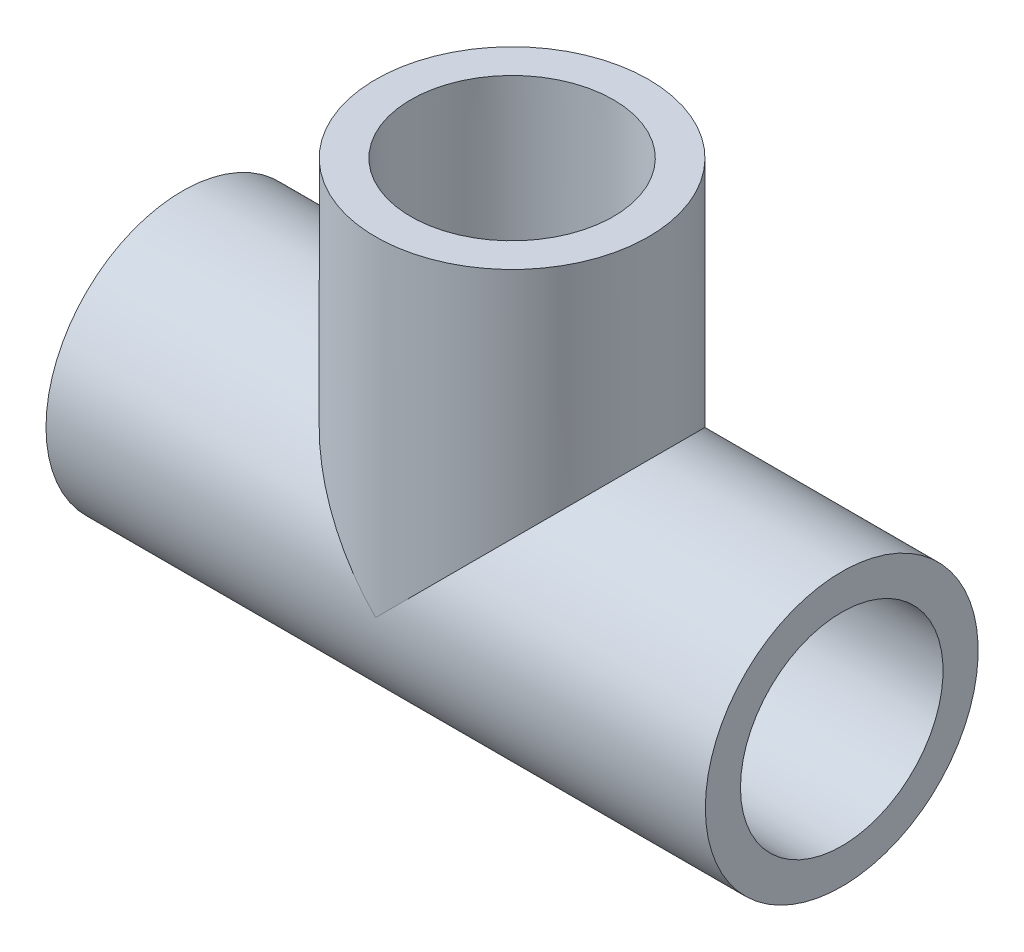
ISO-10303-21;
HEADER;
FILE_DESCRIPTION(('STEP AP214'),'2;1');
FILE_NAME('part.step','',(''),(''),'','','');
FILE_SCHEMA(('AUTOMOTIVE_DESIGN { 1 0 10303 214 1 1 1 1 }'));
ENDSEC;
DATA;
#1=APPLICATION_CONTEXT('core data for automotive mechanical design processes');
#2=APPLICATION_PROTOCOL_DEFINITION('international standard','automotive_design',2000,#1);
#3=PRODUCT_CONTEXT('',#1,'mechanical');
#4=PRODUCT('Part','Part','',(#3));
#5=PRODUCT_RELATED_PRODUCT_CATEGORY('part','',(#4));
#6=PRODUCT_DEFINITION_FORMATION('','',#4);
#7=PRODUCT_DEFINITION_CONTEXT('part definition',#1,'design');
#8=PRODUCT_DEFINITION('design','',#6,#7);
#9=PRODUCT_DEFINITION_SHAPE('','',#8);
#10=(LENGTH_UNIT() NAMED_UNIT(*) SI_UNIT(.MILLI.,.METRE.));
#11=(NAMED_UNIT(*) PLANE_ANGLE_UNIT() SI_UNIT($,.RADIAN.));
#12=(NAMED_UNIT(*) SI_UNIT($,.STERADIAN.) SOLID_ANGLE_UNIT());
#13=UNCERTAINTY_MEASURE_WITH_UNIT(LENGTH_MEASURE(1.E-05),#10,'distance_accuracy_value','');
#14=(GEOMETRIC_REPRESENTATION_CONTEXT(3) GLOBAL_UNCERTAINTY_ASSIGNED_CONTEXT((#13)) GLOBAL_UNIT_ASSIGNED_CONTEXT((#10,
#11,#12)) REPRESENTATION_CONTEXT('',''));
#15=CARTESIAN_POINT('',(0.,0.,0.));
#16=DIRECTION('',(0.,0.,1.));
#17=DIRECTION('',(1.,0.,0.));
#18=AXIS2_PLACEMENT_3D('',#15,#16,#17);
#19=CARTESIAN_POINT('',(-35.052,0.,0.));
#20=DIRECTION('',(-1.,0.,0.));
#21=DIRECTION('',(0.,0.,1.));
#22=AXIS2_PLACEMENT_3D('',#19,#20,#21);
#23=CYLINDRICAL_SURFACE('',#22,14.5034);
#24=CARTESIAN_POINT('',(-35.052,0.,0.));
#25=DIRECTION('',(-1.,0.,0.));
#26=DIRECTION('',(0.,0.,1.));
#27=AXIS2_PLACEMENT_3D('',#24,#25,#26);
#28=CIRCLE('',#27,14.5034);
#29=CARTESIAN_POINT('',(-35.052,0.,14.5034));
#30=VERTEX_POINT('',#29);
#31=EDGE_CURVE('E96',#30,#30,#28,.T.);
#32=ORIENTED_EDGE('',*,*,#31,.F.);
#33=EDGE_LOOP('',(#32));
#34=FACE_BOUND('',#33,.T.);
#35=CARTESIAN_POINT('',(35.052,0.,0.));
#36=DIRECTION('',(-1.,0.,0.));
#37=DIRECTION('',(0.,0.,1.));
#38=AXIS2_PLACEMENT_3D('',#35,#36,#37);
#39=CIRCLE('',#38,14.5034);
#40=CARTESIAN_POINT('',(35.052,0.,14.5034));
#41=VERTEX_POINT('',#40);
#42=EDGE_CURVE('E74',#41,#41,#39,.T.);
#43=ORIENTED_EDGE('',*,*,#42,.T.);
#44=EDGE_LOOP('',(#43));
#45=FACE_BOUND('',#44,.T.);
#46=CARTESIAN_POINT('',(0.,0.,0.));
#47=DIRECTION('',(-0.707106781186547,-0.707106781186547,0.));
#48=DIRECTION('',(-0.707106781186547,0.707106781186547,0.));
#49=AXIS2_PLACEMENT_3D('',#46,#47,#48);
#50=ELLIPSE('',#49,20.5109049805219,14.5034);
#51=CARTESIAN_POINT('',(0.,0.,-14.5034));
#52=VERTEX_POINT('',#51);
#53=CARTESIAN_POINT('',(0.,0.,14.5034));
#54=VERTEX_POINT('',#53);
#55=EDGE_CURVE('E51',#52,#54,#50,.F.);
#56=ORIENTED_EDGE('',*,*,#55,.F.);
#57=CARTESIAN_POINT('',(0.,0.,0.));
#58=DIRECTION('',(0.707106781186547,-0.707106781186547,0.));
#59=DIRECTION('',(-0.707106781186547,-0.707106781186547,0.));
#60=AXIS2_PLACEMENT_3D('',#57,#58,#59);
#61=ELLIPSE('',#60,20.5109049805219,14.5034);
#62=EDGE_CURVE('E87',#52,#54,#61,.T.);
#63=ORIENTED_EDGE('',*,*,#62,.T.);
#64=EDGE_LOOP('',(#56,#63));
#65=FACE_BOUND('',#64,.T.);
#66=ADVANCED_FACE('F32',(#34,#45,#65),#23,.T.);
#67=CARTESIAN_POINT('',(-35.052,-14.5034,0.));
#68=DIRECTION('',(-1.,0.,0.));
#69=DIRECTION('',(0.,0.,1.));
#70=AXIS2_PLACEMENT_3D('',#67,#68,#69);
#71=PLANE('',#70);
#72=ORIENTED_EDGE('',*,*,#31,.T.);
#73=EDGE_LOOP('',(#72));
#74=FACE_BOUND('',#73,.T.);
#75=CARTESIAN_POINT('',(-35.052,0.,0.));
#76=DIRECTION('',(-1.,0.,0.));
#77=DIRECTION('',(0.,0.,1.));
#78=AXIS2_PLACEMENT_3D('',#75,#76,#77);
#79=CIRCLE('',#78,10.7696);
#80=CARTESIAN_POINT('',(-35.052,0.,10.7696));
#81=VERTEX_POINT('',#80);
#82=EDGE_CURVE('E104',#81,#81,#79,.T.);
#83=ORIENTED_EDGE('',*,*,#82,.F.);
#84=EDGE_LOOP('',(#83));
#85=FACE_BOUND('',#84,.T.);
#86=ADVANCED_FACE('F34',(#74,#85),#71,.T.);
#87=CARTESIAN_POINT('',(-12.7,0.,0.));
#88=DIRECTION('',(-1.,0.,0.));
#89=DIRECTION('',(0.,0.,1.));
#90=AXIS2_PLACEMENT_3D('',#87,#88,#89);
#91=CONICAL_SURFACE('',#90,10.6172,0.00681807616748466);
#92=ORIENTED_EDGE('',*,*,#82,.T.);
#93=EDGE_LOOP('',(#92));
#94=FACE_BOUND('',#93,.T.);
#95=CARTESIAN_POINT('',(-12.7,0.,0.));
#96=DIRECTION('',(-1.,0.,0.));
#97=DIRECTION('',(0.,0.,1.));
#98=AXIS2_PLACEMENT_3D('',#95,#96,#97);
#99=CIRCLE('',#98,10.6172);
#100=CARTESIAN_POINT('',(-12.7,0.,10.6172));
#101=VERTEX_POINT('',#100);
#102=EDGE_CURVE('E101',#101,#101,#99,.T.);
#103=ORIENTED_EDGE('',*,*,#102,.F.);
#104=EDGE_LOOP('',(#103));
#105=FACE_BOUND('',#104,.T.);
#106=ADVANCED_FACE('F138',(#94,#105),#91,.F.);
#107=CARTESIAN_POINT('',(52.4670644855765,12.7,-7.00418528881125));
#108=DIRECTION('',(0.,-1.,0.));
#109=DIRECTION('',(0.,0.,-1.));
#110=AXIS2_PLACEMENT_3D('',#107,#108,#109);
#111=PLANE('',#110);
#112=CARTESIAN_POINT('',(0.,12.7,0.));
#113=DIRECTION('',(0.,1.,0.));
#114=DIRECTION('',(0.,0.,1.));
#115=AXIS2_PLACEMENT_3D('',#112,#113,#114);
#116=CIRCLE('',#115,6.9342);
#117=CARTESIAN_POINT('',(0.,12.7,6.9342));
#118=VERTEX_POINT('',#117);
#119=EDGE_CURVE('E72',#118,#118,#116,.T.);
#120=ORIENTED_EDGE('',*,*,#119,.F.);
#121=EDGE_LOOP('',(#120));
#122=FACE_BOUND('',#121,.T.);
#123=CARTESIAN_POINT('',(0.,12.7,0.));
#124=DIRECTION('',(0.,-1.,0.));
#125=DIRECTION('',(0.,0.,-1.));
#126=AXIS2_PLACEMENT_3D('',#123,#124,#125);
#127=CIRCLE('',#126,10.6172);
#128=CARTESIAN_POINT('',(0.,12.7,-10.6172));
#129=VERTEX_POINT('',#128);
#130=EDGE_CURVE('E58',#129,#129,#127,.F.);
#131=ORIENTED_EDGE('',*,*,#130,.T.);
#132=EDGE_LOOP('',(#131));
#133=FACE_BOUND('',#132,.T.);
#134=ADVANCED_FACE('F110',(#122,#133),#111,.F.);
#135=CARTESIAN_POINT('',(-12.7,0.,0.));
#136=DIRECTION('',(1.,0.,0.));
#137=DIRECTION('',(0.,0.,-1.));
#138=AXIS2_PLACEMENT_3D('',#135,#136,#137);
#139=PLANE('',#138);
#140=CARTESIAN_POINT('',(-12.7,0.,0.));
#141=DIRECTION('',(-1.,0.,0.));
#142=DIRECTION('',(0.,0.,1.));
#143=AXIS2_PLACEMENT_3D('',#140,#141,#142);
#144=CIRCLE('',#143,6.9342);
#145=CARTESIAN_POINT('',(-12.7,0.,6.9342));
#146=VERTEX_POINT('',#145);
#147=EDGE_CURVE('E70',#146,#146,#144,.T.);
#148=ORIENTED_EDGE('',*,*,#147,.F.);
#149=EDGE_LOOP('',(#148));
#150=FACE_BOUND('',#149,.T.);
#151=ORIENTED_EDGE('',*,*,#102,.T.);
#152=EDGE_LOOP('',(#151));
#153=FACE_BOUND('',#152,.T.);
#154=ADVANCED_FACE('F123',(#150,#153),#139,.F.);
#155=CARTESIAN_POINT('',(14.5034,35.052,0.));
#156=DIRECTION('',(0.,1.,0.));
#157=DIRECTION('',(0.,0.,1.));
#158=AXIS2_PLACEMENT_3D('',#155,#156,#157);
#159=PLANE('',#158);
#160=CARTESIAN_POINT('',(0.,35.052,0.));
#161=DIRECTION('',(0.,-1.,0.));
#162=DIRECTION('',(0.,0.,-1.));
#163=AXIS2_PLACEMENT_3D('',#160,#161,#162);
#164=CIRCLE('',#163,10.7696);
#165=CARTESIAN_POINT('',(0.,35.052,-10.7696));
#166=VERTEX_POINT('',#165);
#167=EDGE_CURVE('E89',#166,#166,#164,.T.);
#168=ORIENTED_EDGE('',*,*,#167,.T.);
#169=EDGE_LOOP('',(#168));
#170=FACE_BOUND('',#169,.T.);
#171=CARTESIAN_POINT('',(0.,35.052,0.));
#172=DIRECTION('',(0.,-1.,0.));
#173=DIRECTION('',(0.,0.,-1.));
#174=AXIS2_PLACEMENT_3D('',#171,#172,#173);
#175=CIRCLE('',#174,14.5034);
#176=CARTESIAN_POINT('',(0.,35.052,-14.5034));
#177=VERTEX_POINT('',#176);
#178=EDGE_CURVE('E92',#177,#177,#175,.T.);
#179=ORIENTED_EDGE('',*,*,#178,.F.);
#180=EDGE_LOOP('',(#179));
#181=FACE_BOUND('',#180,.T.);
#182=ADVANCED_FACE('F120',(#170,#181),#159,.T.);
#183=CARTESIAN_POINT('',(0.,0.,0.));
#184=DIRECTION('',(0.,-1.,0.));
#185=DIRECTION('',(0.,0.,-1.));
#186=AXIS2_PLACEMENT_3D('',#183,#184,#185);
#187=CYLINDRICAL_SURFACE('',#186,14.5034);
#188=ORIENTED_EDGE('',*,*,#62,.F.);
#189=ORIENTED_EDGE('',*,*,#55,.T.);
#190=EDGE_LOOP('',(#188,#189));
#191=FACE_BOUND('',#190,.T.);
#192=ORIENTED_EDGE('',*,*,#178,.T.);
#193=EDGE_LOOP('',(#192));
#194=FACE_BOUND('',#193,.T.);
#195=ADVANCED_FACE('F116',(#191,#194),#187,.T.);
#196=CARTESIAN_POINT('',(0.,35.052,0.));
#197=DIRECTION('',(0.,1.,0.));
#198=DIRECTION('',(0.,0.,1.));
#199=AXIS2_PLACEMENT_3D('',#196,#197,#198);
#200=CONICAL_SURFACE('',#199,10.7696,0.00681807616748466);
#201=ORIENTED_EDGE('',*,*,#130,.F.);
#202=EDGE_LOOP('',(#201));
#203=FACE_BOUND('',#202,.T.);
#204=ORIENTED_EDGE('',*,*,#167,.F.);
#205=EDGE_LOOP('',(#204));
#206=FACE_BOUND('',#205,.T.);
#207=ADVANCED_FACE('F112',(#203,#206),#200,.F.);
#208=CARTESIAN_POINT('',(35.052,-14.5034,0.));
#209=DIRECTION('',(1.,0.,0.));
#210=DIRECTION('',(0.,0.,1.));
#211=AXIS2_PLACEMENT_3D('',#208,#209,#210);
#212=PLANE('',#211);
#213=ORIENTED_EDGE('',*,*,#42,.F.);
#214=EDGE_LOOP('',(#213));
#215=FACE_BOUND('',#214,.T.);
#216=CARTESIAN_POINT('',(35.052,0.,0.));
#217=DIRECTION('',(-1.,0.,0.));
#218=DIRECTION('',(0.,0.,1.));
#219=AXIS2_PLACEMENT_3D('',#216,#217,#218);
#220=CIRCLE('',#219,10.7696);
#221=CARTESIAN_POINT('',(35.052,0.,10.7696));
#222=VERTEX_POINT('',#221);
#223=EDGE_CURVE('E84',#222,#222,#220,.T.);
#224=ORIENTED_EDGE('',*,*,#223,.T.);
#225=EDGE_LOOP('',(#224));
#226=FACE_BOUND('',#225,.T.);
#227=ADVANCED_FACE('F115',(#215,#226),#212,.T.);
#228=CARTESIAN_POINT('',(12.7,0.,0.));
#229=DIRECTION('',(1.,0.,0.));
#230=DIRECTION('',(0.,0.,1.));
#231=AXIS2_PLACEMENT_3D('',#228,#229,#230);
#232=CONICAL_SURFACE('',#231,10.6172,0.00681807616748466);
#233=ORIENTED_EDGE('',*,*,#223,.F.);
#234=EDGE_LOOP('',(#233));
#235=FACE_BOUND('',#234,.T.);
#236=CARTESIAN_POINT('',(12.7,0.,0.));
#237=DIRECTION('',(-1.,0.,0.));
#238=DIRECTION('',(0.,0.,1.));
#239=AXIS2_PLACEMENT_3D('',#236,#237,#238);
#240=CIRCLE('',#239,10.6172);
#241=CARTESIAN_POINT('',(12.7,0.,10.6172));
#242=VERTEX_POINT('',#241);
#243=EDGE_CURVE('E81',#242,#242,#240,.T.);
#244=ORIENTED_EDGE('',*,*,#243,.T.);
#245=EDGE_LOOP('',(#244));
#246=FACE_BOUND('',#245,.T.);
#247=ADVANCED_FACE('F159',(#235,#246),#232,.F.);
#248=CARTESIAN_POINT('',(12.7,-14.5034,0.));
#249=DIRECTION('',(-1.,0.,0.));
#250=DIRECTION('',(0.,0.,-1.));
#251=AXIS2_PLACEMENT_3D('',#248,#249,#250);
#252=PLANE('',#251);
#253=CARTESIAN_POINT('',(12.7,0.,0.));
#254=DIRECTION('',(-1.,0.,0.));
#255=DIRECTION('',(0.,0.,1.));
#256=AXIS2_PLACEMENT_3D('',#253,#254,#255);
#257=CIRCLE('',#256,6.9342);
#258=CARTESIAN_POINT('',(12.7,0.,6.9342));
#259=VERTEX_POINT('',#258);
#260=EDGE_CURVE('E67',#259,#259,#257,.F.);
#261=ORIENTED_EDGE('',*,*,#260,.F.);
#262=EDGE_LOOP('',(#261));
#263=FACE_BOUND('',#262,.T.);
#264=ORIENTED_EDGE('',*,*,#243,.F.);
#265=EDGE_LOOP('',(#264));
#266=FACE_BOUND('',#265,.T.);
#267=ADVANCED_FACE('F62',(#263,#266),#252,.F.);
#268=CARTESIAN_POINT('',(32.312879368415,0.,0.));
#269=DIRECTION('',(-1.,0.,0.));
#270=DIRECTION('',(0.,0.,1.));
#271=AXIS2_PLACEMENT_3D('',#268,#269,#270);
#272=CYLINDRICAL_SURFACE('',#271,6.9342);
#273=CARTESIAN_POINT('',(0.,0.,0.));
#274=DIRECTION('',(-0.707106781186547,-0.707106781186547,0.));
#275=DIRECTION('',(-0.707106781186547,0.707106781186547,0.));
#276=AXIS2_PLACEMENT_3D('',#273,#274,#275);
#277=ELLIPSE('',#276,9.80643968420752,6.9342);
#278=CARTESIAN_POINT('',(0.,0.,-6.9342));
#279=VERTEX_POINT('',#278);
#280=CARTESIAN_POINT('',(0.,0.,6.9342));
#281=VERTEX_POINT('',#280);
#282=EDGE_CURVE('E40',#279,#281,#277,.F.);
#283=ORIENTED_EDGE('',*,*,#282,.T.);
#284=CARTESIAN_POINT('',(0.,0.,0.));
#285=DIRECTION('',(-0.707106781186547,0.707106781186547,0.));
#286=DIRECTION('',(-0.707106781186547,-0.707106781186547,0.));
#287=AXIS2_PLACEMENT_3D('',#284,#285,#286);
#288=ELLIPSE('',#287,9.80643968420752,6.9342);
#289=EDGE_CURVE('E11',#281,#279,#288,.T.);
#290=ORIENTED_EDGE('',*,*,#289,.T.);
#291=EDGE_LOOP('',(#283,#290));
#292=FACE_BOUND('',#291,.T.);
#293=ORIENTED_EDGE('',*,*,#260,.T.);
#294=EDGE_LOOP('',(#293));
#295=FACE_BOUND('',#294,.T.);
#296=ORIENTED_EDGE('',*,*,#147,.T.);
#297=EDGE_LOOP('',(#296));
#298=FACE_BOUND('',#297,.T.);
#299=ADVANCED_FACE('F59',(#292,#295,#298),#272,.F.);
#300=CARTESIAN_POINT('',(0.,0.,0.));
#301=DIRECTION('',(0.,1.,0.));
#302=DIRECTION('',(0.,0.,1.));
#303=AXIS2_PLACEMENT_3D('',#300,#301,#302);
#304=CYLINDRICAL_SURFACE('',#303,6.9342);
#305=ORIENTED_EDGE('',*,*,#119,.T.);
#306=EDGE_LOOP('',(#305));
#307=FACE_BOUND('',#306,.T.);
#308=ORIENTED_EDGE('',*,*,#282,.F.);
#309=ORIENTED_EDGE('',*,*,#289,.F.);
#310=EDGE_LOOP('',(#308,#309));
#311=FACE_BOUND('',#310,.T.);
#312=ADVANCED_FACE('F56',(#307,#311),#304,.F.);
#313=CLOSED_SHELL('',(#66,#86,#106,#134,#154,#182,#195,#207,#227,#247,#267,#299,#312));
#314=MANIFOLD_SOLID_BREP('B2',#313);
#315=ADVANCED_BREP_SHAPE_REPRESENTATION('',(#18,#314),#14);
#316=SHAPE_DEFINITION_REPRESENTATION(#9,#315);
ENDSEC;
END-ISO-10303-21;
